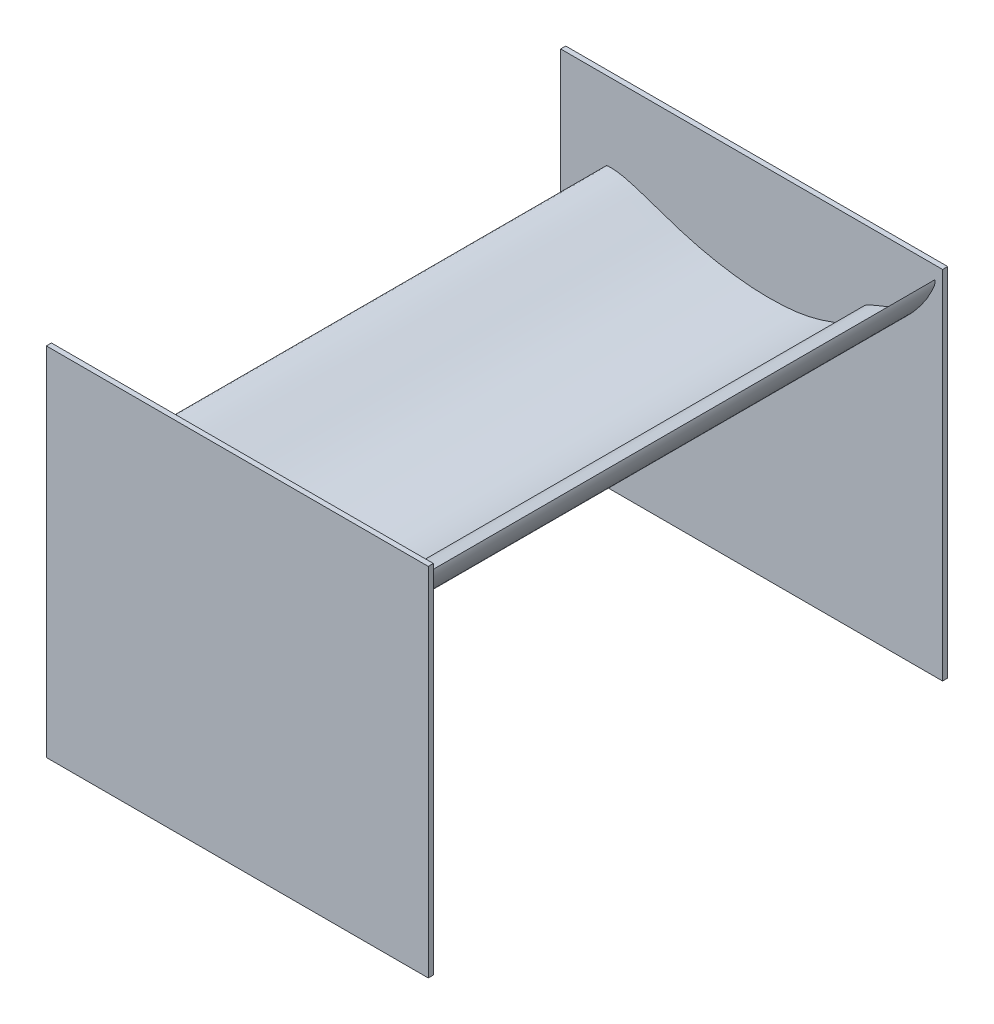
ISO-10303-21;
HEADER;
FILE_DESCRIPTION(('STEP AP214'),'2;1');
FILE_NAME('part.step','',(''),(''),'','','');
FILE_SCHEMA(('AUTOMOTIVE_DESIGN { 1 0 10303 214 1 1 1 1 }'));
ENDSEC;
DATA;
#1=APPLICATION_CONTEXT('core data for automotive mechanical design processes');
#2=APPLICATION_PROTOCOL_DEFINITION('international standard','automotive_design',2000,#1);
#3=PRODUCT_CONTEXT('',#1,'mechanical');
#4=PRODUCT('Part','Part','',(#3));
#5=PRODUCT_RELATED_PRODUCT_CATEGORY('part','',(#4));
#6=PRODUCT_DEFINITION_FORMATION('','',#4);
#7=PRODUCT_DEFINITION_CONTEXT('part definition',#1,'design');
#8=PRODUCT_DEFINITION('design','',#6,#7);
#9=PRODUCT_DEFINITION_SHAPE('','',#8);
#10=(LENGTH_UNIT() NAMED_UNIT(*) SI_UNIT(.MILLI.,.METRE.));
#11=(NAMED_UNIT(*) PLANE_ANGLE_UNIT() SI_UNIT($,.RADIAN.));
#12=(NAMED_UNIT(*) SI_UNIT($,.STERADIAN.) SOLID_ANGLE_UNIT());
#13=UNCERTAINTY_MEASURE_WITH_UNIT(LENGTH_MEASURE(1.E-05),#10,'distance_accuracy_value','');
#14=(GEOMETRIC_REPRESENTATION_CONTEXT(3) GLOBAL_UNCERTAINTY_ASSIGNED_CONTEXT((#13)) GLOBAL_UNIT_ASSIGNED_CONTEXT((#10,
#11,#12)) REPRESENTATION_CONTEXT('',''));
#15=CARTESIAN_POINT('',(0.,0.,0.));
#16=DIRECTION('',(0.,0.,1.));
#17=DIRECTION('',(1.,0.,0.));
#18=AXIS2_PLACEMENT_3D('',#15,#16,#17);
#19=CARTESIAN_POINT('',(0.,0.,0.));
#20=DIRECTION('',(0.,0.,1.));
#21=DIRECTION('',(1.,0.,0.));
#22=AXIS2_PLACEMENT_3D('',#19,#20,#21);
#23=PLANE('',#22);
#24=CARTESIAN_POINT('',(273.299712978964,1047.45924181801,0.));
#25=CARTESIAN_POINT('',(271.501355354195,1047.49714314853,0.));
#26=CARTESIAN_POINT('',(268.935333839832,1047.45862079723,0.));
#27=CARTESIAN_POINT('',(265.939505315287,1047.20209324639,0.));
#28=CARTESIAN_POINT('',(264.564566318725,1047.05271328186,0.));
#29=CARTESIAN_POINT('',(263.813674420036,1046.88467552736,0.));
#30=CARTESIAN_POINT('',(263.388633667222,1046.74138422288,0.));
#31=CARTESIAN_POINT('',(263.030882370473,1046.56914235734,0.));
#32=CARTESIAN_POINT('',(262.72359100929,1046.36780452043,0.));
#33=CARTESIAN_POINT('',(262.423321422774,1046.10363217531,0.));
#34=CARTESIAN_POINT('',(262.09115865647,1045.72021037039,0.));
#35=CARTESIAN_POINT('',(261.668419190282,1045.07844679946,0.));
#36=CARTESIAN_POINT('',(261.323583140103,1044.37432086651,0.));
#37=CARTESIAN_POINT('',(260.89977269643,1043.36478184622,0.));
#38=CARTESIAN_POINT('',(260.518417740157,1042.17581697044,0.));
#39=CARTESIAN_POINT('',(260.22469576341,1040.56281707426,0.));
#40=CARTESIAN_POINT('',(260.138135098674,1039.06434583294,0.));
#41=CARTESIAN_POINT('',(260.203063122095,1037.09214786162,0.));
#42=CARTESIAN_POINT('',(260.611872972944,1034.20212866157,0.));
#43=CARTESIAN_POINT('',(261.580690993355,1030.67510966762,0.));
#44=CARTESIAN_POINT('',(262.924936167258,1026.53626815487,0.));
#45=CARTESIAN_POINT('',(264.596716896282,1022.29037801087,0.));
#46=CARTESIAN_POINT('',(267.035615286334,1017.6559299152,0.));
#47=CARTESIAN_POINT('',(270.009457862836,1013.02917999467,0.));
#48=CARTESIAN_POINT('',(273.632028611518,1008.26358873022,0.));
#49=CARTESIAN_POINT('',(277.935771872126,1003.38587489967,0.));
#50=CARTESIAN_POINT('',(282.941696886936,998.478252720664,0.));
#51=CARTESIAN_POINT('',(288.613294541212,993.619147129829,0.));
#52=CARTESIAN_POINT('',(294.983232627773,988.81130685789,0.));
#53=CARTESIAN_POINT('',(302.118947935058,984.023338084991,0.));
#54=CARTESIAN_POINT('',(308.778415274983,980.041290493165,0.));
#55=CARTESIAN_POINT('',(316.02667249154,976.106358714042,0.));
#56=CARTESIAN_POINT('',(323.739917947677,972.327810125775,0.));
#57=CARTESIAN_POINT('',(333.232925599972,968.263721419377,0.));
#58=CARTESIAN_POINT('',(343.221010036048,964.560966365891,0.));
#59=CARTESIAN_POINT('',(353.709288129129,961.233979804842,0.));
#60=CARTESIAN_POINT('',(364.679055460699,958.307258750135,0.));
#61=CARTESIAN_POINT('',(372.749680261371,956.531908465284,0.));
#62=CARTESIAN_POINT('',(381.498353904149,954.801019637278,0.));
#63=CARTESIAN_POINT('',(391.043359437042,953.143578783363,0.));
#64=CARTESIAN_POINT('',(405.421970477268,951.114933645766,0.));
#65=CARTESIAN_POINT('',(421.094244252914,949.326195385743,0.));
#66=CARTESIAN_POINT('',(437.613792232812,947.990281359828,0.));
#67=CARTESIAN_POINT('',(454.031107784313,947.24890983834,0.));
#68=CARTESIAN_POINT('',(470.05903254369,947.11319949093,0.));
#69=CARTESIAN_POINT('',(486.066732644042,947.517716420878,0.));
#70=CARTESIAN_POINT('',(502.604583945234,948.469446243578,0.));
#71=CARTESIAN_POINT('',(519.666548518223,949.992414414784,0.));
#72=CARTESIAN_POINT('',(537.309174727318,952.10401092601,0.));
#73=CARTESIAN_POINT('',(555.417065812161,954.79345528198,0.));
#74=CARTESIAN_POINT('',(574.256086511726,958.110054986406,0.));
#75=CARTESIAN_POINT('',(593.929976525561,962.092902134031,0.));
#76=CARTESIAN_POINT('',(613.479460616961,966.522733281033,0.));
#77=CARTESIAN_POINT('',(632.248568521534,971.26887023469,0.));
#78=CARTESIAN_POINT('',(650.223764529532,976.3241944404,0.));
#79=CARTESIAN_POINT('',(667.769452220553,981.823217486045,0.));
#80=CARTESIAN_POINT('',(685.092355157296,987.874337913877,0.));
#81=CARTESIAN_POINT('',(701.773807616945,994.298766738725,0.));
#82=CARTESIAN_POINT('',(717.160205750105,1000.80700390757,0.));
#83=CARTESIAN_POINT('',(730.651265057758,1006.97118190653,0.));
#84=CARTESIAN_POINT('',(741.192814950402,1012.23074840225,0.));
#85=CARTESIAN_POINT('',(749.127527913007,1016.52220400929,0.));
#86=CARTESIAN_POINT('',(754.972629258018,1020.0120965144,0.));
#87=CARTESIAN_POINT('',(759.653468517524,1023.28306910494,0.));
#88=CARTESIAN_POINT('',(763.739864161134,1026.69777677455,0.));
#89=CARTESIAN_POINT('',(767.581583797698,1030.7159639199,0.));
#90=CARTESIAN_POINT('',(770.276177429681,1034.08723585971,0.));
#91=CARTESIAN_POINT('',(775.398740275752,1041.41835338453,0.));
#92=CARTESIAN_POINT('',(767.166879825847,1032.40522998706,0.));
#93=CARTESIAN_POINT('',(762.514436028774,1029.07305066966,0.));
#94=CARTESIAN_POINT('',(756.057294195145,1024.31088319617,0.));
#95=CARTESIAN_POINT('',(749.561358229946,1020.4131543083,0.));
#96=CARTESIAN_POINT('',(742.404140579619,1016.6392482191,0.));
#97=CARTESIAN_POINT('',(733.82716496417,1012.70305847589,0.));
#98=CARTESIAN_POINT('',(721.478784182814,1007.74740437754,0.));
#99=CARTESIAN_POINT('',(707.436834403415,1002.53654793299,0.));
#100=CARTESIAN_POINT('',(692.95385082075,997.416011510719,0.));
#101=CARTESIAN_POINT('',(680.508215201084,993.568550593356,0.));
#102=CARTESIAN_POINT('',(668.097102094708,990.236350557277,0.));
#103=CARTESIAN_POINT('',(655.603931210656,987.45278636365,0.));
#104=CARTESIAN_POINT('',(642.86274947735,985.196412287056,0.));
#105=CARTESIAN_POINT('',(630.135759526326,983.513369063551,0.));
#106=CARTESIAN_POINT('',(617.08130883258,982.341702283071,0.));
#107=CARTESIAN_POINT('',(603.127332505453,981.563579542028,0.));
#108=CARTESIAN_POINT('',(587.780241229943,981.131091145351,0.));
#109=CARTESIAN_POINT('',(571.414754972608,981.189588101737,0.));
#110=CARTESIAN_POINT('',(554.748610523876,981.817396349114,0.));
#111=CARTESIAN_POINT('',(537.695772248325,983.059469228186,0.));
#112=CARTESIAN_POINT('',(520.269878600214,984.920915856248,0.));
#113=CARTESIAN_POINT('',(502.232039320122,987.417966685022,0.));
#114=CARTESIAN_POINT('',(483.775625836703,990.476782520715,0.));
#115=CARTESIAN_POINT('',(465.058500382055,994.099847318854,0.));
#116=CARTESIAN_POINT('',(446.544938305797,998.281923251767,0.));
#117=CARTESIAN_POINT('',(428.619106679511,1002.94413087325,0.));
#118=CARTESIAN_POINT('',(410.542007430251,1008.17678908451,0.));
#119=CARTESIAN_POINT('',(391.371985369232,1014.218797921,0.));
#120=CARTESIAN_POINT('',(370.526687937025,1021.27441790733,0.));
#121=CARTESIAN_POINT('',(350.022594856783,1028.50628972639,0.));
#122=CARTESIAN_POINT('',(331.74706073568,1034.66476528182,0.));
#123=CARTESIAN_POINT('',(317.275489281966,1039.12552566214,0.));
#124=CARTESIAN_POINT('',(305.63469302552,1042.34715389404,0.));
#125=CARTESIAN_POINT('',(295.850133380513,1044.63590198182,0.));
#126=CARTESIAN_POINT('',(287.313017908039,1046.20470166339,0.));
#127=CARTESIAN_POINT('',(279.935988714214,1047.12947871134,0.));
#128=CARTESIAN_POINT('',(275.363404042483,1047.41574844606,0.));
#129=CARTESIAN_POINT('',(273.299712978964,1047.45924181801,0.));
#130=B_SPLINE_CURVE_WITH_KNOTS('',3,(#24,#25,#26,#27,#28,#29,#30,#31,#32,#33,#34,#35,#36,#37,
#38,#39,#40,#41,#42,#43,#44,#45,#46,#47,#48,#49,#50,#51,#52,#53,#54,#55,#56,#57,#58,#59,#60,#61,
#62,#63,#64,#65,#66,#67,#68,#69,#70,#71,#72,#73,#74,#75,#76,#77,#78,#79,#80,#81,#82,#83,#84,#85,
#86,#87,#88,#89,#90,#91,#92,#93,#94,#95,#96,#97,#98,#99,#100,#101,#102,#103,#104,#105,#106,#107,
#108,#109,#110,#111,#112,#113,#114,#115,#116,#117,#118,#119,#120,#121,#122,#123,#124,#125,#126,
#127,#128,#129),.UNSPECIFIED.,.T.,.F.,(4,1,1,1,1,1,1,1,1,1,1,1,1,1,1,1,1,1,1,1,1,1,1,1,1,1,1,1,
1,1,1,1,1,1,1,1,1,1,1,1,1,1,1,1,1,1,1,1,1,1,1,1,1,1,1,1,1,1,1,1,1,1,1,1,1,1,1,1,1,1,1,1,1,1,1,1,
1,1,1,1,1,1,1,1,1,1,1,1,1,1,1,1,1,1,1,1,1,1,1,1,1,1,1,4),(0.,0.00486498720637252,
0.00693254524521891,0.00813788435669305,0.00860149727128035,0.00901181840696386,
0.00934865279773456,0.0096731642835618,0.0100026596108538,0.0104275748205012,0.0110418174822611,
0.0120766326629139,0.0125434720315457,0.014004596260203,0.0154435818399652,0.0169687663105577,
0.0180560683135106,0.0207795247726854,0.0248406343782316,0.0279358855564014,0.0325554535440554,
0.0371663626143194,0.0420821080159116,0.0474218776089789,0.0533481896207324,0.0596674467011705,
0.0663745655860388,0.0735423368115471,0.0812490197247285,0.0896154033323993,0.0945263674953617,
0.103562344523124,0.112843807907009,0.122455999221578,0.132373756408963,0.14260534815104,
0.153165587614205,0.154726060672372,0.166736316983418,0.179371763289159,0.194012659114079,
0.209411026755962,0.224206692179842,0.238469752089365,0.252771690585992,0.267526239366753,
0.283284172444976,0.299113578757103,0.315597400733655,0.332811402570589,0.350865810671034,
0.369905470866038,0.387043715821497,0.403243824516595,0.420423249014811,0.436786871378303,
0.452885030332324,0.468782715546349,0.48198343638645,0.49301168675148,0.500654808832816,
0.506381799232014,0.511437541320662,0.516043966627856,0.520925913945336,0.525830531207915,
0.529953558671425,0.536609682497579,0.543291188228846,0.550106034163821,0.557026954660342,
0.564113346016075,0.571894396282258,0.58258008266935,0.600094179547477,0.61242484092006,
0.624138462179078,0.635332149629944,0.64718748312066,0.6587592246628,0.670332543322906,
0.681912601165571,0.694215176194797,0.708142392645253,0.723449251782781,0.73848835212507,
0.753260173450307,0.769704083265492,0.785898215648005,0.802525572661821,0.820318822274027,
0.837475337311733,0.853872349782661,0.870428328602395,0.888390885544636,0.908253004939095,
0.929971273954701,0.947220557189022,0.960430627996534,0.970941391538835,0.979895840022844,
0.987611288807097,0.99441722242359,1.),.UNSPECIFIED.);
#131=CARTESIAN_POINT('',(273.299712978964,1047.45924181801,0.));
#132=VERTEX_POINT('',#131);
#133=EDGE_CURVE('E84',#132,#132,#130,.T.);
#134=ORIENTED_EDGE('',*,*,#133,.F.);
#135=EDGE_LOOP('',(#134));
#136=FACE_BOUND('',#135,.T.);
#137=DIRECTION('',(0.,-1.,0.));
#138=VECTOR('',#137,1.);
#139=CARTESIAN_POINT('',(923.,0.,0.));
#140=LINE('',#139,#138);
#141=CARTESIAN_POINT('',(923.,1200.,0.));
#142=VERTEX_POINT('',#141);
#143=CARTESIAN_POINT('',(923.,500.,0.));
#144=VERTEX_POINT('',#143);
#145=EDGE_CURVE('E205',#142,#144,#140,.T.);
#146=ORIENTED_EDGE('',*,*,#145,.F.);
#147=DIRECTION('',(1.,0.,0.));
#148=VECTOR('',#147,1.);
#149=CARTESIAN_POINT('',(0.,1200.,0.));
#150=LINE('',#149,#148);
#151=CARTESIAN_POINT('',(173.,1200.,0.));
#152=VERTEX_POINT('',#151);
#153=EDGE_CURVE('E253',#152,#142,#150,.T.);
#154=ORIENTED_EDGE('',*,*,#153,.F.);
#155=DIRECTION('',(0.,-1.,0.));
#156=VECTOR('',#155,1.);
#157=CARTESIAN_POINT('',(173.,0.,0.));
#158=LINE('',#157,#156);
#159=CARTESIAN_POINT('',(173.,500.,0.));
#160=VERTEX_POINT('',#159);
#161=EDGE_CURVE('E257',#152,#160,#158,.T.);
#162=ORIENTED_EDGE('',*,*,#161,.T.);
#163=DIRECTION('',(1.,0.,0.));
#164=VECTOR('',#163,1.);
#165=CARTESIAN_POINT('',(0.,500.,0.));
#166=LINE('',#165,#164);
#167=EDGE_CURVE('E255',#160,#144,#166,.T.);
#168=ORIENTED_EDGE('',*,*,#167,.T.);
#169=EDGE_LOOP('',(#146,#154,#162,#168));
#170=FACE_BOUND('',#169,.T.);
#171=CARTESIAN_POINT('',(770.198118118824,1062.25924181801,0.));
#172=CARTESIAN_POINT('',(769.701305805667,1061.85559247131,0.));
#173=CARTESIAN_POINT('',(769.013734262179,1061.25450448536,0.));
#174=CARTESIAN_POINT('',(768.259688955732,1060.49531756154,0.));
#175=CARTESIAN_POINT('',(767.920903164386,1060.13829877015,0.));
#176=CARTESIAN_POINT('',(767.755783207504,1059.91985583616,0.));
#177=CARTESIAN_POINT('',(767.673405810876,1059.78313190751,0.));
#178=CARTESIAN_POINT('',(767.615954982367,1059.65403888592,0.));
#179=CARTESIAN_POINT('',(767.578896527597,1059.52866357941,0.));
#180=CARTESIAN_POINT('',(767.558206739122,1059.38785072699,0.));
#181=CARTESIAN_POINT('',(767.556309075683,1059.20733163728,0.));
#182=CARTESIAN_POINT('',(767.589291870628,1058.93584811532,0.));
#183=CARTESIAN_POINT('',(767.657772490403,1058.66537033795,0.));
#184=CARTESIAN_POINT('',(767.77511714352,1058.29382315683,0.));
#185=CARTESIAN_POINT('',(767.945283806028,1057.8833505589,0.));
#186=CARTESIAN_POINT('',(768.236836796396,1057.37796240095,0.));
#187=CARTESIAN_POINT('',(768.558253419234,1056.9513414713,0.));
#188=CARTESIAN_POINT('',(769.02982507548,1056.43101621685,0.));
#189=CARTESIAN_POINT('',(769.80598800409,1055.74073989482,0.));
#190=CARTESIAN_POINT('',(770.880762659817,1055.00647642226,0.));
#191=CARTESIAN_POINT('',(772.198257137504,1054.19257326658,0.));
#192=CARTESIAN_POINT('',(773.629287204178,1053.42500660341,0.));
#193=CARTESIAN_POINT('',(775.357955165086,1052.7285531818,0.));
#194=CARTESIAN_POINT('',(777.230039258929,1052.15731961565,0.));
#195=CARTESIAN_POINT('',(779.310151014132,1051.6977240997,0.));
#196=CARTESIAN_POINT('',(781.600946098188,1051.3644861799,0.));
#197=CARTESIAN_POINT('',(784.089202968187,1051.18475523291,0.));
#198=CARTESIAN_POINT('',(786.746961342947,1051.17141293569,0.));
#199=CARTESIAN_POINT('',(789.58245483047,1051.33272460819,0.));
#200=CARTESIAN_POINT('',(792.621212361905,1051.67569195002,0.));
#201=CARTESIAN_POINT('',(795.345209947722,1052.12777249706,0.));
#202=CARTESIAN_POINT('',(798.218164874995,1052.72816506098,0.));
#203=CARTESIAN_POINT('',(801.18132584239,1053.47802968715,0.));
#204=CARTESIAN_POINT('',(804.693252311382,1054.5600523533,0.));
#205=CARTESIAN_POINT('',(808.256376717907,1055.8540978635,0.));
#206=CARTESIAN_POINT('',(811.868765289586,1057.36526172038,0.));
#207=CARTESIAN_POINT('',(815.519702912353,1059.09588732587,0.));
#208=CARTESIAN_POINT('',(818.118774276321,1060.4716953272,0.));
#209=CARTESIAN_POINT('',(820.89163953154,1062.01564007003,0.));
#210=CARTESIAN_POINT('',(823.863729669769,1063.7628144643,0.));
#211=CARTESIAN_POINT('',(828.23314009207,1066.52181382558,0.));
#212=CARTESIAN_POINT('',(832.898440302782,1069.64369397123,0.));
#213=CARTESIAN_POINT('',(837.689468800288,1073.08349508862,0.));
#214=CARTESIAN_POINT('',(842.315902090018,1076.66112841645,0.));
#215=CARTESIAN_POINT('',(846.697243900953,1080.31351511647,0.));
#216=CARTESIAN_POINT('',(850.948750037444,1084.10786854468,0.));
#217=CARTESIAN_POINT('',(855.218188922964,1088.17276713991,0.));
#218=CARTESIAN_POINT('',(859.498391768868,1092.5133418224,0.));
#219=CARTESIAN_POINT('',(863.800703513088,1097.14732836393,0.));
#220=CARTESIAN_POINT('',(868.096285962998,1102.04523946185,0.));
#221=CARTESIAN_POINT('',(872.445947568327,1107.28165284334,0.));
#222=CARTESIAN_POINT('',(876.868846095541,1112.89105664354,0.));
#223=CARTESIAN_POINT('',(881.155095559438,1118.59314034331,0.));
#224=CARTESIAN_POINT('',(885.156739262287,1124.20144922697,0.));
#225=CARTESIAN_POINT('',(888.871742015828,1129.71093568765,0.));
#226=CARTESIAN_POINT('',(892.368044678175,1135.24198363894,0.));
#227=CARTESIAN_POINT('',(895.67680306879,1140.87159578966,0.));
#228=CARTESIAN_POINT('',(898.725540685174,1146.45488123098,0.));
#229=CARTESIAN_POINT('',(901.403499835371,1151.76282443449,0.));
#230=CARTESIAN_POINT('',(903.646242779225,1156.54112861019,0.));
#231=CARTESIAN_POINT('',(905.296684186183,1160.39501226168,0.));
#232=CARTESIAN_POINT('',(906.462444001126,1163.3861156243,0.));
#233=CARTESIAN_POINT('',(907.245566185517,1165.67869315361,0.));
#234=CARTESIAN_POINT('',(907.763088271198,1167.64387065504,0.));
#235=CARTESIAN_POINT('',(908.086189537716,1169.51123322501,0.));
#236=CARTESIAN_POINT('',(908.203978226784,1171.48606669029,0.));
#237=CARTESIAN_POINT('',(908.159331285953,1173.02128313078,0.));
#238=CARTESIAN_POINT('',(907.86219879773,1176.19008938303,0.));
#239=CARTESIAN_POINT('',(907.702598338451,1171.8490924985,0.));
#240=CARTESIAN_POINT('',(907.206871232144,1169.87383892169,0.));
#241=CARTESIAN_POINT('',(906.550481702573,1167.09507985367,0.));
#242=CARTESIAN_POINT('',(905.684591422257,1164.54200679195,0.));
#243=CARTESIAN_POINT('',(904.610723244629,1161.87033003025,0.));
#244=CARTESIAN_POINT('',(903.18887515561,1158.82781613078,0.));
#245=CARTESIAN_POINT('',(900.978092760961,1154.64053029753,0.));
#246=CARTESIAN_POINT('',(898.366403502034,1149.99416414579,0.));
#247=CARTESIAN_POINT('',(895.614224836741,1145.27079682315,0.));
#248=CARTESIAN_POINT('',(893.121968904145,1141.36189774526,0.));
#249=CARTESIAN_POINT('',(890.520482737667,1137.60079072241,0.));
#250=CARTESIAN_POINT('',(887.770443465119,1133.96970017127,0.));
#251=CARTESIAN_POINT('',(884.83174637769,1130.42460738827,0.));
#252=CARTESIAN_POINT('',(881.764934909514,1127.0383876912,0.));
#253=CARTESIAN_POINT('',(878.491542205427,1123.71558646744,0.));
#254=CARTESIAN_POINT('',(874.883427372514,1120.29254832681,0.));
#255=CARTESIAN_POINT('',(870.817653981425,1116.64265852812,0.));
#256=CARTESIAN_POINT('',(866.362467880527,1112.89161745817,0.));
#257=CARTESIAN_POINT('',(861.694639842188,1109.2258880984,0.));
#258=CARTESIAN_POINT('',(856.780472006081,1105.63786792949,0.));
#259=CARTESIAN_POINT('',(851.622489967364,1102.13208283041,0.));
#260=CARTESIAN_POINT('',(846.152121196005,1098.65795142748,0.));
#261=CARTESIAN_POINT('',(840.438844116974,1095.23994235494,0.));
#262=CARTESIAN_POINT('',(834.524932037551,1091.91506563805,0.));
#263=CARTESIAN_POINT('',(828.537598550904,1088.78876403532,0.));
#264=CARTESIAN_POINT('',(822.599265656619,1085.9280545084,0.));
#265=CARTESIAN_POINT('',(816.488574361757,1083.18735180561,0.));
#266=CARTESIAN_POINT('',(809.894963351208,1080.41475026263,0.));
#267=CARTESIAN_POINT('',(802.613361999438,1077.53164508248,0.));
#268=CARTESIAN_POINT('',(795.38379751312,1074.77491257583,0.));
#269=CARTESIAN_POINT('',(789.006149890907,1072.23980932936,0.));
#270=CARTESIAN_POINT('',(784.051698373744,1070.11950804331,0.));
#271=CARTESIAN_POINT('',(780.150758115055,1068.31446881677,0.));
#272=CARTESIAN_POINT('',(776.968340281636,1066.68349691967,0.));
#273=CARTESIAN_POINT('',(774.290202364673,1065.14425520448,0.));
#274=CARTESIAN_POINT('',(772.075158568497,1063.69724296312,0.));
#275=CARTESIAN_POINT('',(770.768231157959,1062.72244643211,0.));
#276=CARTESIAN_POINT('',(770.198118118824,1062.25924181801,0.));
#277=B_SPLINE_CURVE_WITH_KNOTS('',3,(#171,#172,#173,#174,#175,#176,#177,#178,#179,#180,#181,
#182,#183,#184,#185,#186,#187,#188,#189,#190,#191,#192,#193,#194,#195,#196,#197,#198,#199,#200,
#201,#202,#203,#204,#205,#206,#207,#208,#209,#210,#211,#212,#213,#214,#215,#216,#217,#218,#219,
#220,#221,#222,#223,#224,#225,#226,#227,#228,#229,#230,#231,#232,#233,#234,#235,#236,#237,#238,
#239,#240,#241,#242,#243,#244,#245,#246,#247,#248,#249,#250,#251,#252,#253,#254,#255,#256,#257,
#258,#259,#260,#261,#262,#263,#264,#265,#266,#267,#268,#269,#270,#271,#272,#273,#274,#275,#276),
.UNSPECIFIED.,.T.,.F.,(4,1,1,1,1,1,1,1,1,1,1,1,1,1,1,1,1,1,1,1,1,1,1,1,1,1,1,1,1,1,1,1,1,1,1,1,
1,1,1,1,1,1,1,1,1,1,1,1,1,1,1,1,1,1,1,1,1,1,1,1,1,1,1,1,1,1,1,1,1,1,1,1,1,1,1,1,1,1,1,1,1,1,1,1,
1,1,1,1,1,1,1,1,1,1,1,1,1,1,1,1,1,1,1,4),(0.,0.00486498720637252,0.00693254524521891,
0.00813788435669305,0.00860149727128035,0.00901181840696386,0.00934865279773456,
0.0096731642835618,0.0100026596108538,0.0104275748205012,0.0110418174822611,0.0120766326629139,
0.0125434720315457,0.014004596260203,0.0154435818399652,0.0169687663105577,0.0180560683135106,
0.0207795247726854,0.0248406343782316,0.0279358855564014,0.0325554535440554,0.0371663626143194,
0.0420821080159116,0.0474218776089789,0.0533481896207324,0.0596674467011705,0.0663745655860388,
0.0735423368115471,0.0812490197247285,0.0896154033323993,0.0945263674953617,0.103562344523124,
0.112843807907009,0.122455999221578,0.132373756408963,0.14260534815104,0.153165587614205,
0.154726060672372,0.166736316983418,0.179371763289159,0.194012659114079,0.209411026755962,
0.224206692179842,0.238469752089365,0.252771690585992,0.267526239366753,0.283284172444976,
0.299113578757103,0.315597400733655,0.332811402570589,0.350865810671034,0.369905470866038,
0.387043715821497,0.403243824516595,0.420423249014811,0.436786871378303,0.452885030332324,
0.468782715546349,0.48198343638645,0.49301168675148,0.500654808832816,0.506381799232014,
0.511437541320662,0.516043966627856,0.520925913945336,0.525830531207915,0.529953558671425,
0.536609682497579,0.543291188228846,0.550106034163821,0.557026954660342,0.564113346016075,
0.571894396282258,0.58258008266935,0.600094179547477,0.61242484092006,0.624138462179078,
0.635332149629944,0.64718748312066,0.6587592246628,0.670332543322906,0.681912601165571,
0.694215176194797,0.708142392645253,0.723449251782781,0.73848835212507,0.753260173450307,
0.769704083265492,0.785898215648005,0.802525572661821,0.820318822274027,0.837475337311733,
0.853872349782661,0.870428328602395,0.888390885544636,0.908253004939095,0.929971273954701,
0.947220557189022,0.960430627996534,0.970941391538835,0.979895840022844,0.987611288807097,
0.99441722242359,1.),.UNSPECIFIED.);
#278=CARTESIAN_POINT('',(770.198118118824,1062.25924181801,0.));
#279=VERTEX_POINT('',#278);
#280=EDGE_CURVE('E200',#279,#279,#277,.T.);
#281=ORIENTED_EDGE('',*,*,#280,.F.);
#282=EDGE_LOOP('',(#281));
#283=FACE_BOUND('',#282,.T.);
#284=ADVANCED_FACE('F79',(#136,#170,#283),#23,.T.);
#285=CARTESIAN_POINT('',(273.299712978964,1047.45924181801,1000.));
#286=CARTESIAN_POINT('',(271.501355354195,1047.49714314853,1000.));
#287=CARTESIAN_POINT('',(268.935333839832,1047.45862079723,1000.));
#288=CARTESIAN_POINT('',(265.939505315287,1047.20209324639,1000.));
#289=CARTESIAN_POINT('',(264.564566318725,1047.05271328186,1000.));
#290=CARTESIAN_POINT('',(263.813674420036,1046.88467552736,1000.));
#291=CARTESIAN_POINT('',(263.388633667222,1046.74138422288,1000.));
#292=CARTESIAN_POINT('',(263.030882370473,1046.56914235734,1000.));
#293=CARTESIAN_POINT('',(262.72359100929,1046.36780452043,1000.));
#294=CARTESIAN_POINT('',(262.423321422774,1046.10363217531,1000.));
#295=CARTESIAN_POINT('',(262.09115865647,1045.72021037039,1000.));
#296=CARTESIAN_POINT('',(261.668419190282,1045.07844679946,1000.));
#297=CARTESIAN_POINT('',(261.323583140103,1044.37432086651,1000.));
#298=CARTESIAN_POINT('',(260.89977269643,1043.36478184622,1000.));
#299=CARTESIAN_POINT('',(260.518417740157,1042.17581697044,1000.));
#300=CARTESIAN_POINT('',(260.22469576341,1040.56281707426,1000.));
#301=CARTESIAN_POINT('',(260.138135098674,1039.06434583294,1000.));
#302=CARTESIAN_POINT('',(260.203063122095,1037.09214786162,1000.));
#303=CARTESIAN_POINT('',(260.611872972944,1034.20212866157,1000.));
#304=CARTESIAN_POINT('',(261.580690993355,1030.67510966762,1000.));
#305=CARTESIAN_POINT('',(262.924936167258,1026.53626815487,1000.));
#306=CARTESIAN_POINT('',(264.596716896282,1022.29037801087,1000.));
#307=CARTESIAN_POINT('',(267.035615286334,1017.6559299152,1000.));
#308=CARTESIAN_POINT('',(270.009457862836,1013.02917999467,1000.));
#309=CARTESIAN_POINT('',(273.632028611518,1008.26358873022,1000.));
#310=CARTESIAN_POINT('',(277.935771872126,1003.38587489967,1000.));
#311=CARTESIAN_POINT('',(282.941696886936,998.478252720664,1000.));
#312=CARTESIAN_POINT('',(288.613294541212,993.619147129829,1000.));
#313=CARTESIAN_POINT('',(294.983232627773,988.81130685789,1000.));
#314=CARTESIAN_POINT('',(302.118947935058,984.023338084991,1000.));
#315=CARTESIAN_POINT('',(308.778415274983,980.041290493165,1000.));
#316=CARTESIAN_POINT('',(316.02667249154,976.106358714042,1000.));
#317=CARTESIAN_POINT('',(323.739917947677,972.327810125775,1000.));
#318=CARTESIAN_POINT('',(333.232925599972,968.263721419377,1000.));
#319=CARTESIAN_POINT('',(343.221010036048,964.560966365891,1000.));
#320=CARTESIAN_POINT('',(353.709288129129,961.233979804842,1000.));
#321=CARTESIAN_POINT('',(364.679055460699,958.307258750135,1000.));
#322=CARTESIAN_POINT('',(372.749680261371,956.531908465284,1000.));
#323=CARTESIAN_POINT('',(381.498353904149,954.801019637278,1000.));
#324=CARTESIAN_POINT('',(391.043359437042,953.143578783363,1000.));
#325=CARTESIAN_POINT('',(405.421970477268,951.114933645766,1000.));
#326=CARTESIAN_POINT('',(421.094244252914,949.326195385743,1000.));
#327=CARTESIAN_POINT('',(437.613792232812,947.990281359828,1000.));
#328=CARTESIAN_POINT('',(454.031107784313,947.24890983834,1000.));
#329=CARTESIAN_POINT('',(470.05903254369,947.11319949093,1000.));
#330=CARTESIAN_POINT('',(486.066732644042,947.517716420878,1000.));
#331=CARTESIAN_POINT('',(502.604583945234,948.469446243578,1000.));
#332=CARTESIAN_POINT('',(519.666548518223,949.992414414784,1000.));
#333=CARTESIAN_POINT('',(537.309174727318,952.10401092601,1000.));
#334=CARTESIAN_POINT('',(555.417065812161,954.79345528198,1000.));
#335=CARTESIAN_POINT('',(574.256086511726,958.110054986406,1000.));
#336=CARTESIAN_POINT('',(593.929976525561,962.092902134031,1000.));
#337=CARTESIAN_POINT('',(613.479460616961,966.522733281033,1000.));
#338=CARTESIAN_POINT('',(632.248568521534,971.26887023469,1000.));
#339=CARTESIAN_POINT('',(650.223764529532,976.3241944404,1000.));
#340=CARTESIAN_POINT('',(667.769452220553,981.823217486045,1000.));
#341=CARTESIAN_POINT('',(685.092355157296,987.874337913877,1000.));
#342=CARTESIAN_POINT('',(701.773807616945,994.298766738725,1000.));
#343=CARTESIAN_POINT('',(717.160205750105,1000.80700390757,1000.));
#344=CARTESIAN_POINT('',(730.651265057758,1006.97118190653,1000.));
#345=CARTESIAN_POINT('',(741.192814950402,1012.23074840225,1000.));
#346=CARTESIAN_POINT('',(749.127527913007,1016.52220400929,1000.));
#347=CARTESIAN_POINT('',(754.972629258018,1020.0120965144,1000.));
#348=CARTESIAN_POINT('',(759.653468517524,1023.28306910494,1000.));
#349=CARTESIAN_POINT('',(763.739864161134,1026.69777677455,1000.));
#350=CARTESIAN_POINT('',(767.581583797698,1030.7159639199,1000.));
#351=CARTESIAN_POINT('',(770.276177429681,1034.08723585971,1000.));
#352=CARTESIAN_POINT('',(775.398740275752,1041.41835338453,1000.));
#353=CARTESIAN_POINT('',(767.166879825847,1032.40522998706,1000.));
#354=CARTESIAN_POINT('',(762.514436028774,1029.07305066966,1000.));
#355=CARTESIAN_POINT('',(756.057294195145,1024.31088319617,1000.));
#356=CARTESIAN_POINT('',(749.561358229946,1020.4131543083,1000.));
#357=CARTESIAN_POINT('',(742.404140579619,1016.6392482191,1000.));
#358=CARTESIAN_POINT('',(733.82716496417,1012.70305847589,1000.));
#359=CARTESIAN_POINT('',(721.478784182814,1007.74740437754,1000.));
#360=CARTESIAN_POINT('',(707.436834403415,1002.53654793299,1000.));
#361=CARTESIAN_POINT('',(692.95385082075,997.416011510719,1000.));
#362=CARTESIAN_POINT('',(680.508215201084,993.568550593356,1000.));
#363=CARTESIAN_POINT('',(668.097102094708,990.236350557277,1000.));
#364=CARTESIAN_POINT('',(655.603931210656,987.45278636365,1000.));
#365=CARTESIAN_POINT('',(642.86274947735,985.196412287056,1000.));
#366=CARTESIAN_POINT('',(630.135759526326,983.513369063551,1000.));
#367=CARTESIAN_POINT('',(617.08130883258,982.341702283071,1000.));
#368=CARTESIAN_POINT('',(603.127332505453,981.563579542028,1000.));
#369=CARTESIAN_POINT('',(587.780241229943,981.131091145351,1000.));
#370=CARTESIAN_POINT('',(571.414754972608,981.189588101737,1000.));
#371=CARTESIAN_POINT('',(554.748610523876,981.817396349114,1000.));
#372=CARTESIAN_POINT('',(537.695772248325,983.059469228186,1000.));
#373=CARTESIAN_POINT('',(520.269878600214,984.920915856248,1000.));
#374=CARTESIAN_POINT('',(502.232039320122,987.417966685022,1000.));
#375=CARTESIAN_POINT('',(483.775625836703,990.476782520715,1000.));
#376=CARTESIAN_POINT('',(465.058500382055,994.099847318854,1000.));
#377=CARTESIAN_POINT('',(446.544938305797,998.281923251767,1000.));
#378=CARTESIAN_POINT('',(428.619106679511,1002.94413087325,1000.));
#379=CARTESIAN_POINT('',(410.542007430251,1008.17678908451,1000.));
#380=CARTESIAN_POINT('',(391.371985369232,1014.218797921,1000.));
#381=CARTESIAN_POINT('',(370.526687937025,1021.27441790733,1000.));
#382=CARTESIAN_POINT('',(350.022594856783,1028.50628972639,1000.));
#383=CARTESIAN_POINT('',(331.74706073568,1034.66476528182,1000.));
#384=CARTESIAN_POINT('',(317.275489281966,1039.12552566214,1000.));
#385=CARTESIAN_POINT('',(305.63469302552,1042.34715389404,1000.));
#386=CARTESIAN_POINT('',(295.850133380513,1044.63590198182,1000.));
#387=CARTESIAN_POINT('',(287.313017908039,1046.20470166339,1000.));
#388=CARTESIAN_POINT('',(279.935988714214,1047.12947871134,1000.));
#389=CARTESIAN_POINT('',(275.363404042483,1047.41574844606,1000.));
#390=CARTESIAN_POINT('',(273.299712978964,1047.45924181801,1000.));
#391=B_SPLINE_CURVE_WITH_KNOTS('',3,(#285,#286,#287,#288,#289,#290,#291,#292,#293,#294,#295,
#296,#297,#298,#299,#300,#301,#302,#303,#304,#305,#306,#307,#308,#309,#310,#311,#312,#313,#314,
#315,#316,#317,#318,#319,#320,#321,#322,#323,#324,#325,#326,#327,#328,#329,#330,#331,#332,#333,
#334,#335,#336,#337,#338,#339,#340,#341,#342,#343,#344,#345,#346,#347,#348,#349,#350,#351,#352,
#353,#354,#355,#356,#357,#358,#359,#360,#361,#362,#363,#364,#365,#366,#367,#368,#369,#370,#371,
#372,#373,#374,#375,#376,#377,#378,#379,#380,#381,#382,#383,#384,#385,#386,#387,#388,#389,#390),
.UNSPECIFIED.,.T.,.F.,(4,1,1,1,1,1,1,1,1,1,1,1,1,1,1,1,1,1,1,1,1,1,1,1,1,1,1,1,1,1,1,1,1,1,1,1,
1,1,1,1,1,1,1,1,1,1,1,1,1,1,1,1,1,1,1,1,1,1,1,1,1,1,1,1,1,1,1,1,1,1,1,1,1,1,1,1,1,1,1,1,1,1,1,1,
1,1,1,1,1,1,1,1,1,1,1,1,1,1,1,1,1,1,1,4),(0.,0.00486498720637252,0.00693254524521891,
0.00813788435669305,0.00860149727128035,0.00901181840696386,0.00934865279773456,
0.0096731642835618,0.0100026596108538,0.0104275748205012,0.0110418174822611,0.0120766326629139,
0.0125434720315457,0.014004596260203,0.0154435818399652,0.0169687663105577,0.0180560683135106,
0.0207795247726854,0.0248406343782316,0.0279358855564014,0.0325554535440554,0.0371663626143194,
0.0420821080159116,0.0474218776089789,0.0533481896207324,0.0596674467011705,0.0663745655860388,
0.0735423368115471,0.0812490197247285,0.0896154033323993,0.0945263674953617,0.103562344523124,
0.112843807907009,0.122455999221578,0.132373756408963,0.14260534815104,0.153165587614205,
0.154726060672372,0.166736316983418,0.179371763289159,0.194012659114079,0.209411026755962,
0.224206692179842,0.238469752089365,0.252771690585992,0.267526239366753,0.283284172444976,
0.299113578757103,0.315597400733655,0.332811402570589,0.350865810671034,0.369905470866038,
0.387043715821497,0.403243824516595,0.420423249014811,0.436786871378303,0.452885030332324,
0.468782715546349,0.48198343638645,0.49301168675148,0.500654808832816,0.506381799232014,
0.511437541320662,0.516043966627856,0.520925913945336,0.525830531207915,0.529953558671425,
0.536609682497579,0.543291188228846,0.550106034163821,0.557026954660342,0.564113346016075,
0.571894396282258,0.58258008266935,0.600094179547477,0.61242484092006,0.624138462179078,
0.635332149629944,0.64718748312066,0.6587592246628,0.670332543322906,0.681912601165571,
0.694215176194797,0.708142392645253,0.723449251782781,0.73848835212507,0.753260173450307,
0.769704083265492,0.785898215648005,0.802525572661821,0.820318822274027,0.837475337311733,
0.853872349782661,0.870428328602395,0.888390885544636,0.908253004939095,0.929971273954701,
0.947220557189022,0.960430627996534,0.970941391538835,0.979895840022844,0.987611288807097,
0.99441722242359,1.),.UNSPECIFIED.);
#392=DIRECTION('',(0.,0.,-1.));
#393=VECTOR('',#392,1.);
#394=SURFACE_OF_LINEAR_EXTRUSION('',#391,#393);
#395=CARTESIAN_POINT('',(273.299712978964,1047.45924181801,1000.));
#396=VERTEX_POINT('',#395);
#397=EDGE_CURVE('E12',#396,#396,#391,.T.);
#398=ORIENTED_EDGE('',*,*,#397,.F.);
#399=EDGE_LOOP('',(#398));
#400=FACE_BOUND('',#399,.T.);
#401=ORIENTED_EDGE('',*,*,#133,.T.);
#402=EDGE_LOOP('',(#401));
#403=FACE_BOUND('',#402,.T.);
#404=ADVANCED_FACE('F81',(#400,#403),#394,.F.);
#405=CARTESIAN_POINT('',(923.,0.,-10.));
#406=DIRECTION('',(-1.,0.,0.));
#407=DIRECTION('',(0.,0.,1.));
#408=AXIS2_PLACEMENT_3D('',#405,#406,#407);
#409=PLANE('',#408);
#410=ORIENTED_EDGE('',*,*,#145,.T.);
#411=DIRECTION('',(0.,0.,1.));
#412=VECTOR('',#411,1.);
#413=CARTESIAN_POINT('',(923.,500.,-10.));
#414=LINE('',#413,#412);
#415=CARTESIAN_POINT('',(923.,500.,-10.));
#416=VERTEX_POINT('',#415);
#417=EDGE_CURVE('E123',#416,#144,#414,.T.);
#418=ORIENTED_EDGE('',*,*,#417,.F.);
#419=DIRECTION('',(0.,-1.,0.));
#420=VECTOR('',#419,1.);
#421=CARTESIAN_POINT('',(923.,0.,-10.));
#422=LINE('',#421,#420);
#423=CARTESIAN_POINT('',(923.,1200.,-10.));
#424=VERTEX_POINT('',#423);
#425=EDGE_CURVE('E98',#424,#416,#422,.T.);
#426=ORIENTED_EDGE('',*,*,#425,.F.);
#427=DIRECTION('',(0.,0.,1.));
#428=VECTOR('',#427,1.);
#429=CARTESIAN_POINT('',(923.,1200.,-10.));
#430=LINE('',#429,#428);
#431=EDGE_CURVE('E250',#424,#142,#430,.T.);
#432=ORIENTED_EDGE('',*,*,#431,.T.);
#433=EDGE_LOOP('',(#410,#418,#426,#432));
#434=FACE_BOUND('',#433,.T.);
#435=ADVANCED_FACE('F236',(#434),#409,.F.);
#436=CARTESIAN_POINT('',(0.,500.,-10.));
#437=DIRECTION('',(0.,-1.,0.));
#438=DIRECTION('',(1.,0.,0.));
#439=AXIS2_PLACEMENT_3D('',#436,#437,#438);
#440=PLANE('',#439);
#441=ORIENTED_EDGE('',*,*,#167,.F.);
#442=DIRECTION('',(0.,0.,1.));
#443=VECTOR('',#442,1.);
#444=CARTESIAN_POINT('',(173.,500.,-10.));
#445=LINE('',#444,#443);
#446=CARTESIAN_POINT('',(173.,500.,-10.));
#447=VERTEX_POINT('',#446);
#448=EDGE_CURVE('E116',#447,#160,#445,.T.);
#449=ORIENTED_EDGE('',*,*,#448,.F.);
#450=DIRECTION('',(1.,0.,0.));
#451=VECTOR('',#450,1.);
#452=CARTESIAN_POINT('',(0.,500.,-10.));
#453=LINE('',#452,#451);
#454=EDGE_CURVE('E266',#447,#416,#453,.T.);
#455=ORIENTED_EDGE('',*,*,#454,.T.);
#456=ORIENTED_EDGE('',*,*,#417,.T.);
#457=EDGE_LOOP('',(#441,#449,#455,#456));
#458=FACE_BOUND('',#457,.T.);
#459=ADVANCED_FACE('F232',(#458),#440,.T.);
#460=CARTESIAN_POINT('',(173.,0.,-10.));
#461=DIRECTION('',(-1.,0.,0.));
#462=DIRECTION('',(0.,-1.,0.));
#463=AXIS2_PLACEMENT_3D('',#460,#461,#462);
#464=PLANE('',#463);
#465=ORIENTED_EDGE('',*,*,#161,.F.);
#466=DIRECTION('',(0.,0.,1.));
#467=VECTOR('',#466,1.);
#468=CARTESIAN_POINT('',(173.,1200.,-10.));
#469=LINE('',#468,#467);
#470=CARTESIAN_POINT('',(173.,1200.,-10.));
#471=VERTEX_POINT('',#470);
#472=EDGE_CURVE('E264',#471,#152,#469,.T.);
#473=ORIENTED_EDGE('',*,*,#472,.F.);
#474=DIRECTION('',(0.,-1.,0.));
#475=VECTOR('',#474,1.);
#476=CARTESIAN_POINT('',(173.,0.,-10.));
#477=LINE('',#476,#475);
#478=EDGE_CURVE('E273',#471,#447,#477,.T.);
#479=ORIENTED_EDGE('',*,*,#478,.T.);
#480=ORIENTED_EDGE('',*,*,#448,.T.);
#481=EDGE_LOOP('',(#465,#473,#479,#480));
#482=FACE_BOUND('',#481,.T.);
#483=ADVANCED_FACE('F235',(#482),#464,.T.);
#484=CARTESIAN_POINT('',(0.,1200.,-10.));
#485=DIRECTION('',(0.,-1.,0.));
#486=DIRECTION('',(0.,0.,-1.));
#487=AXIS2_PLACEMENT_3D('',#484,#485,#486);
#488=PLANE('',#487);
#489=ORIENTED_EDGE('',*,*,#153,.T.);
#490=ORIENTED_EDGE('',*,*,#431,.F.);
#491=DIRECTION('',(1.,0.,0.));
#492=VECTOR('',#491,1.);
#493=CARTESIAN_POINT('',(0.,1200.,-10.));
#494=LINE('',#493,#492);
#495=EDGE_CURVE('E128',#471,#424,#494,.T.);
#496=ORIENTED_EDGE('',*,*,#495,.F.);
#497=ORIENTED_EDGE('',*,*,#472,.T.);
#498=EDGE_LOOP('',(#489,#490,#496,#497));
#499=FACE_BOUND('',#498,.T.);
#500=ADVANCED_FACE('F228',(#499),#488,.F.);
#501=CARTESIAN_POINT('',(0.,0.,-10.));
#502=DIRECTION('',(0.,0.,1.));
#503=DIRECTION('',(1.,0.,0.));
#504=AXIS2_PLACEMENT_3D('',#501,#502,#503);
#505=PLANE('',#504);
#506=ORIENTED_EDGE('',*,*,#425,.T.);
#507=ORIENTED_EDGE('',*,*,#454,.F.);
#508=ORIENTED_EDGE('',*,*,#478,.F.);
#509=ORIENTED_EDGE('',*,*,#495,.T.);
#510=EDGE_LOOP('',(#506,#507,#508,#509));
#511=FACE_BOUND('',#510,.T.);
#512=ADVANCED_FACE('F223',(#511),#505,.F.);
#513=CARTESIAN_POINT('',(770.198118118824,1062.25924181801,1000.));
#514=CARTESIAN_POINT('',(769.701305805667,1061.85559247131,1000.));
#515=CARTESIAN_POINT('',(769.013734262179,1061.25450448536,1000.));
#516=CARTESIAN_POINT('',(768.259688955732,1060.49531756154,1000.));
#517=CARTESIAN_POINT('',(767.920903164386,1060.13829877015,1000.));
#518=CARTESIAN_POINT('',(767.755783207504,1059.91985583616,1000.));
#519=CARTESIAN_POINT('',(767.673405810876,1059.78313190751,1000.));
#520=CARTESIAN_POINT('',(767.615954982367,1059.65403888592,1000.));
#521=CARTESIAN_POINT('',(767.578896527597,1059.52866357941,1000.));
#522=CARTESIAN_POINT('',(767.558206739122,1059.38785072699,1000.));
#523=CARTESIAN_POINT('',(767.556309075683,1059.20733163728,1000.));
#524=CARTESIAN_POINT('',(767.589291870628,1058.93584811532,1000.));
#525=CARTESIAN_POINT('',(767.657772490403,1058.66537033795,1000.));
#526=CARTESIAN_POINT('',(767.77511714352,1058.29382315683,1000.));
#527=CARTESIAN_POINT('',(767.945283806028,1057.8833505589,1000.));
#528=CARTESIAN_POINT('',(768.236836796396,1057.37796240095,1000.));
#529=CARTESIAN_POINT('',(768.558253419234,1056.9513414713,1000.));
#530=CARTESIAN_POINT('',(769.02982507548,1056.43101621685,1000.));
#531=CARTESIAN_POINT('',(769.80598800409,1055.74073989482,1000.));
#532=CARTESIAN_POINT('',(770.880762659817,1055.00647642226,1000.));
#533=CARTESIAN_POINT('',(772.198257137504,1054.19257326658,1000.));
#534=CARTESIAN_POINT('',(773.629287204178,1053.42500660341,1000.));
#535=CARTESIAN_POINT('',(775.357955165086,1052.7285531818,1000.));
#536=CARTESIAN_POINT('',(777.230039258929,1052.15731961565,1000.));
#537=CARTESIAN_POINT('',(779.310151014132,1051.6977240997,1000.));
#538=CARTESIAN_POINT('',(781.600946098188,1051.3644861799,1000.));
#539=CARTESIAN_POINT('',(784.089202968187,1051.18475523291,1000.));
#540=CARTESIAN_POINT('',(786.746961342947,1051.17141293569,1000.));
#541=CARTESIAN_POINT('',(789.58245483047,1051.33272460819,1000.));
#542=CARTESIAN_POINT('',(792.621212361905,1051.67569195002,1000.));
#543=CARTESIAN_POINT('',(795.345209947722,1052.12777249706,1000.));
#544=CARTESIAN_POINT('',(798.218164874995,1052.72816506098,1000.));
#545=CARTESIAN_POINT('',(801.18132584239,1053.47802968715,1000.));
#546=CARTESIAN_POINT('',(804.693252311382,1054.5600523533,1000.));
#547=CARTESIAN_POINT('',(808.256376717907,1055.8540978635,1000.));
#548=CARTESIAN_POINT('',(811.868765289586,1057.36526172038,1000.));
#549=CARTESIAN_POINT('',(815.519702912353,1059.09588732587,1000.));
#550=CARTESIAN_POINT('',(818.118774276321,1060.4716953272,1000.));
#551=CARTESIAN_POINT('',(820.89163953154,1062.01564007003,1000.));
#552=CARTESIAN_POINT('',(823.863729669769,1063.7628144643,1000.));
#553=CARTESIAN_POINT('',(828.23314009207,1066.52181382558,1000.));
#554=CARTESIAN_POINT('',(832.898440302782,1069.64369397123,1000.));
#555=CARTESIAN_POINT('',(837.689468800288,1073.08349508862,1000.));
#556=CARTESIAN_POINT('',(842.315902090018,1076.66112841645,1000.));
#557=CARTESIAN_POINT('',(846.697243900953,1080.31351511647,1000.));
#558=CARTESIAN_POINT('',(850.948750037444,1084.10786854468,1000.));
#559=CARTESIAN_POINT('',(855.218188922964,1088.17276713991,1000.));
#560=CARTESIAN_POINT('',(859.498391768868,1092.5133418224,1000.));
#561=CARTESIAN_POINT('',(863.800703513088,1097.14732836393,1000.));
#562=CARTESIAN_POINT('',(868.096285962998,1102.04523946185,1000.));
#563=CARTESIAN_POINT('',(872.445947568327,1107.28165284334,1000.));
#564=CARTESIAN_POINT('',(876.868846095541,1112.89105664354,1000.));
#565=CARTESIAN_POINT('',(881.155095559438,1118.59314034331,1000.));
#566=CARTESIAN_POINT('',(885.156739262287,1124.20144922697,1000.));
#567=CARTESIAN_POINT('',(888.871742015828,1129.71093568765,1000.));
#568=CARTESIAN_POINT('',(892.368044678175,1135.24198363894,1000.));
#569=CARTESIAN_POINT('',(895.67680306879,1140.87159578966,1000.));
#570=CARTESIAN_POINT('',(898.725540685174,1146.45488123098,1000.));
#571=CARTESIAN_POINT('',(901.403499835371,1151.76282443449,1000.));
#572=CARTESIAN_POINT('',(903.646242779225,1156.54112861019,1000.));
#573=CARTESIAN_POINT('',(905.296684186183,1160.39501226168,1000.));
#574=CARTESIAN_POINT('',(906.462444001126,1163.3861156243,1000.));
#575=CARTESIAN_POINT('',(907.245566185517,1165.67869315361,1000.));
#576=CARTESIAN_POINT('',(907.763088271198,1167.64387065504,1000.));
#577=CARTESIAN_POINT('',(908.086189537716,1169.51123322501,1000.));
#578=CARTESIAN_POINT('',(908.203978226784,1171.48606669029,1000.));
#579=CARTESIAN_POINT('',(908.159331285953,1173.02128313078,1000.));
#580=CARTESIAN_POINT('',(907.86219879773,1176.19008938303,1000.));
#581=CARTESIAN_POINT('',(907.702598338451,1171.8490924985,1000.));
#582=CARTESIAN_POINT('',(907.206871232144,1169.87383892169,1000.));
#583=CARTESIAN_POINT('',(906.550481702573,1167.09507985367,1000.));
#584=CARTESIAN_POINT('',(905.684591422257,1164.54200679195,1000.));
#585=CARTESIAN_POINT('',(904.610723244629,1161.87033003025,1000.));
#586=CARTESIAN_POINT('',(903.18887515561,1158.82781613078,1000.));
#587=CARTESIAN_POINT('',(900.978092760961,1154.64053029753,1000.));
#588=CARTESIAN_POINT('',(898.366403502034,1149.99416414579,1000.));
#589=CARTESIAN_POINT('',(895.614224836741,1145.27079682315,1000.));
#590=CARTESIAN_POINT('',(893.121968904145,1141.36189774526,1000.));
#591=CARTESIAN_POINT('',(890.520482737667,1137.60079072241,1000.));
#592=CARTESIAN_POINT('',(887.770443465119,1133.96970017127,1000.));
#593=CARTESIAN_POINT('',(884.83174637769,1130.42460738827,1000.));
#594=CARTESIAN_POINT('',(881.764934909514,1127.0383876912,1000.));
#595=CARTESIAN_POINT('',(878.491542205427,1123.71558646744,1000.));
#596=CARTESIAN_POINT('',(874.883427372514,1120.29254832681,1000.));
#597=CARTESIAN_POINT('',(870.817653981425,1116.64265852812,1000.));
#598=CARTESIAN_POINT('',(866.362467880527,1112.89161745817,1000.));
#599=CARTESIAN_POINT('',(861.694639842188,1109.2258880984,1000.));
#600=CARTESIAN_POINT('',(856.780472006081,1105.63786792949,1000.));
#601=CARTESIAN_POINT('',(851.622489967364,1102.13208283041,1000.));
#602=CARTESIAN_POINT('',(846.152121196005,1098.65795142748,1000.));
#603=CARTESIAN_POINT('',(840.438844116974,1095.23994235494,1000.));
#604=CARTESIAN_POINT('',(834.524932037551,1091.91506563805,1000.));
#605=CARTESIAN_POINT('',(828.537598550904,1088.78876403532,1000.));
#606=CARTESIAN_POINT('',(822.599265656619,1085.9280545084,1000.));
#607=CARTESIAN_POINT('',(816.488574361757,1083.18735180561,1000.));
#608=CARTESIAN_POINT('',(809.894963351208,1080.41475026263,1000.));
#609=CARTESIAN_POINT('',(802.613361999438,1077.53164508248,1000.));
#610=CARTESIAN_POINT('',(795.38379751312,1074.77491257583,1000.));
#611=CARTESIAN_POINT('',(789.006149890907,1072.23980932936,1000.));
#612=CARTESIAN_POINT('',(784.051698373744,1070.11950804331,1000.));
#613=CARTESIAN_POINT('',(780.150758115055,1068.31446881677,1000.));
#614=CARTESIAN_POINT('',(776.968340281636,1066.68349691967,1000.));
#615=CARTESIAN_POINT('',(774.290202364673,1065.14425520448,1000.));
#616=CARTESIAN_POINT('',(772.075158568497,1063.69724296312,1000.));
#617=CARTESIAN_POINT('',(770.768231157959,1062.72244643211,1000.));
#618=CARTESIAN_POINT('',(770.198118118824,1062.25924181801,1000.));
#619=B_SPLINE_CURVE_WITH_KNOTS('',3,(#513,#514,#515,#516,#517,#518,#519,#520,#521,#522,#523,
#524,#525,#526,#527,#528,#529,#530,#531,#532,#533,#534,#535,#536,#537,#538,#539,#540,#541,#542,
#543,#544,#545,#546,#547,#548,#549,#550,#551,#552,#553,#554,#555,#556,#557,#558,#559,#560,#561,
#562,#563,#564,#565,#566,#567,#568,#569,#570,#571,#572,#573,#574,#575,#576,#577,#578,#579,#580,
#581,#582,#583,#584,#585,#586,#587,#588,#589,#590,#591,#592,#593,#594,#595,#596,#597,#598,#599,
#600,#601,#602,#603,#604,#605,#606,#607,#608,#609,#610,#611,#612,#613,#614,#615,#616,#617,#618),
.UNSPECIFIED.,.T.,.F.,(4,1,1,1,1,1,1,1,1,1,1,1,1,1,1,1,1,1,1,1,1,1,1,1,1,1,1,1,1,1,1,1,1,1,1,1,
1,1,1,1,1,1,1,1,1,1,1,1,1,1,1,1,1,1,1,1,1,1,1,1,1,1,1,1,1,1,1,1,1,1,1,1,1,1,1,1,1,1,1,1,1,1,1,1,
1,1,1,1,1,1,1,1,1,1,1,1,1,1,1,1,1,1,1,4),(0.,0.00486498720637252,0.00693254524521891,
0.00813788435669305,0.00860149727128035,0.00901181840696386,0.00934865279773456,
0.0096731642835618,0.0100026596108538,0.0104275748205012,0.0110418174822611,0.0120766326629139,
0.0125434720315457,0.014004596260203,0.0154435818399652,0.0169687663105577,0.0180560683135106,
0.0207795247726854,0.0248406343782316,0.0279358855564014,0.0325554535440554,0.0371663626143194,
0.0420821080159116,0.0474218776089789,0.0533481896207324,0.0596674467011705,0.0663745655860388,
0.0735423368115471,0.0812490197247285,0.0896154033323993,0.0945263674953617,0.103562344523124,
0.112843807907009,0.122455999221578,0.132373756408963,0.14260534815104,0.153165587614205,
0.154726060672372,0.166736316983418,0.179371763289159,0.194012659114079,0.209411026755962,
0.224206692179842,0.238469752089365,0.252771690585992,0.267526239366753,0.283284172444976,
0.299113578757103,0.315597400733655,0.332811402570589,0.350865810671034,0.369905470866038,
0.387043715821497,0.403243824516595,0.420423249014811,0.436786871378303,0.452885030332324,
0.468782715546349,0.48198343638645,0.49301168675148,0.500654808832816,0.506381799232014,
0.511437541320662,0.516043966627856,0.520925913945336,0.525830531207915,0.529953558671425,
0.536609682497579,0.543291188228846,0.550106034163821,0.557026954660342,0.564113346016075,
0.571894396282258,0.58258008266935,0.600094179547477,0.61242484092006,0.624138462179078,
0.635332149629944,0.64718748312066,0.6587592246628,0.670332543322906,0.681912601165571,
0.694215176194797,0.708142392645253,0.723449251782781,0.73848835212507,0.753260173450307,
0.769704083265492,0.785898215648005,0.802525572661821,0.820318822274027,0.837475337311733,
0.853872349782661,0.870428328602395,0.888390885544636,0.908253004939095,0.929971273954701,
0.947220557189022,0.960430627996534,0.970941391538835,0.979895840022844,0.987611288807097,
0.99441722242359,1.),.UNSPECIFIED.);
#620=DIRECTION('',(0.,0.,-1.));
#621=VECTOR('',#620,1.);
#622=SURFACE_OF_LINEAR_EXTRUSION('',#619,#621);
#623=CARTESIAN_POINT('',(770.198118118824,1062.25924181801,1000.));
#624=VERTEX_POINT('',#623);
#625=EDGE_CURVE('E196',#624,#624,#619,.T.);
#626=ORIENTED_EDGE('',*,*,#625,.F.);
#627=EDGE_LOOP('',(#626));
#628=FACE_BOUND('',#627,.T.);
#629=ORIENTED_EDGE('',*,*,#280,.T.);
#630=EDGE_LOOP('',(#629));
#631=FACE_BOUND('',#630,.T.);
#632=ADVANCED_FACE('F219',(#628,#631),#622,.F.);
#633=CARTESIAN_POINT('',(923.,0.,1010.));
#634=DIRECTION('',(1.,0.,0.));
#635=DIRECTION('',(0.,0.,-1.));
#636=AXIS2_PLACEMENT_3D('',#633,#634,#635);
#637=PLANE('',#636);
#638=DIRECTION('',(0.,-1.,0.));
#639=VECTOR('',#638,1.);
#640=CARTESIAN_POINT('',(923.,0.,1000.));
#641=LINE('',#640,#639);
#642=CARTESIAN_POINT('',(923.,1200.,1000.));
#643=VERTEX_POINT('',#642);
#644=CARTESIAN_POINT('',(923.,500.,1000.));
#645=VERTEX_POINT('',#644);
#646=EDGE_CURVE('E190',#643,#645,#641,.T.);
#647=ORIENTED_EDGE('',*,*,#646,.F.);
#648=DIRECTION('',(0.,0.,-1.));
#649=VECTOR('',#648,1.);
#650=CARTESIAN_POINT('',(923.,1200.,1010.));
#651=LINE('',#650,#649);
#652=CARTESIAN_POINT('',(923.,1200.,1010.));
#653=VERTEX_POINT('',#652);
#654=EDGE_CURVE('E181',#653,#643,#651,.T.);
#655=ORIENTED_EDGE('',*,*,#654,.F.);
#656=DIRECTION('',(0.,-1.,0.));
#657=VECTOR('',#656,1.);
#658=CARTESIAN_POINT('',(923.,0.,1010.));
#659=LINE('',#658,#657);
#660=CARTESIAN_POINT('',(923.,500.,1010.));
#661=VERTEX_POINT('',#660);
#662=EDGE_CURVE('E162',#653,#661,#659,.T.);
#663=ORIENTED_EDGE('',*,*,#662,.T.);
#664=DIRECTION('',(0.,0.,-1.));
#665=VECTOR('',#664,1.);
#666=CARTESIAN_POINT('',(923.,500.,1010.));
#667=LINE('',#666,#665);
#668=EDGE_CURVE('E171',#661,#645,#667,.T.);
#669=ORIENTED_EDGE('',*,*,#668,.T.);
#670=EDGE_LOOP('',(#647,#655,#663,#669));
#671=FACE_BOUND('',#670,.T.);
#672=ADVANCED_FACE('F180',(#671),#637,.T.);
#673=CARTESIAN_POINT('',(0.,1200.,1010.));
#674=DIRECTION('',(0.,1.,0.));
#675=DIRECTION('',(0.,0.,1.));
#676=AXIS2_PLACEMENT_3D('',#673,#674,#675);
#677=PLANE('',#676);
#678=DIRECTION('',(1.,0.,0.));
#679=VECTOR('',#678,1.);
#680=CARTESIAN_POINT('',(0.,1200.,1000.));
#681=LINE('',#680,#679);
#682=CARTESIAN_POINT('',(173.,1200.,1000.));
#683=VERTEX_POINT('',#682);
#684=EDGE_CURVE('E182',#683,#643,#681,.T.);
#685=ORIENTED_EDGE('',*,*,#684,.F.);
#686=DIRECTION('',(0.,0.,-1.));
#687=VECTOR('',#686,1.);
#688=CARTESIAN_POINT('',(173.,1200.,1010.));
#689=LINE('',#688,#687);
#690=CARTESIAN_POINT('',(173.,1200.,1010.));
#691=VERTEX_POINT('',#690);
#692=EDGE_CURVE('E197',#691,#683,#689,.T.);
#693=ORIENTED_EDGE('',*,*,#692,.F.);
#694=DIRECTION('',(1.,0.,0.));
#695=VECTOR('',#694,1.);
#696=CARTESIAN_POINT('',(0.,1200.,1010.));
#697=LINE('',#696,#695);
#698=EDGE_CURVE('E178',#691,#653,#697,.T.);
#699=ORIENTED_EDGE('',*,*,#698,.T.);
#700=ORIENTED_EDGE('',*,*,#654,.T.);
#701=EDGE_LOOP('',(#685,#693,#699,#700));
#702=FACE_BOUND('',#701,.T.);
#703=ADVANCED_FACE('F294',(#702),#677,.T.);
#704=CARTESIAN_POINT('',(173.,0.,1010.));
#705=DIRECTION('',(1.,0.,0.));
#706=DIRECTION('',(0.,1.,0.));
#707=AXIS2_PLACEMENT_3D('',#704,#705,#706);
#708=PLANE('',#707);
#709=DIRECTION('',(0.,-1.,0.));
#710=VECTOR('',#709,1.);
#711=CARTESIAN_POINT('',(173.,0.,1000.));
#712=LINE('',#711,#710);
#713=CARTESIAN_POINT('',(173.,500.,1000.));
#714=VERTEX_POINT('',#713);
#715=EDGE_CURVE('E185',#683,#714,#712,.T.);
#716=ORIENTED_EDGE('',*,*,#715,.T.);
#717=DIRECTION('',(0.,0.,-1.));
#718=VECTOR('',#717,1.);
#719=CARTESIAN_POINT('',(173.,500.,1010.));
#720=LINE('',#719,#718);
#721=CARTESIAN_POINT('',(173.,500.,1010.));
#722=VERTEX_POINT('',#721);
#723=EDGE_CURVE('E177',#722,#714,#720,.T.);
#724=ORIENTED_EDGE('',*,*,#723,.F.);
#725=DIRECTION('',(0.,-1.,0.));
#726=VECTOR('',#725,1.);
#727=CARTESIAN_POINT('',(173.,0.,1010.));
#728=LINE('',#727,#726);
#729=EDGE_CURVE('E165',#691,#722,#728,.T.);
#730=ORIENTED_EDGE('',*,*,#729,.F.);
#731=ORIENTED_EDGE('',*,*,#692,.T.);
#732=EDGE_LOOP('',(#716,#724,#730,#731));
#733=FACE_BOUND('',#732,.T.);
#734=ADVANCED_FACE('F296',(#733),#708,.F.);
#735=CARTESIAN_POINT('',(0.,500.,1010.));
#736=DIRECTION('',(0.,1.,0.));
#737=DIRECTION('',(-1.,0.,0.));
#738=AXIS2_PLACEMENT_3D('',#735,#736,#737);
#739=PLANE('',#738);
#740=DIRECTION('',(1.,0.,0.));
#741=VECTOR('',#740,1.);
#742=CARTESIAN_POINT('',(0.,500.,1000.));
#743=LINE('',#742,#741);
#744=EDGE_CURVE('E173',#714,#645,#743,.T.);
#745=ORIENTED_EDGE('',*,*,#744,.T.);
#746=ORIENTED_EDGE('',*,*,#668,.F.);
#747=DIRECTION('',(1.,0.,0.));
#748=VECTOR('',#747,1.);
#749=CARTESIAN_POINT('',(0.,500.,1010.));
#750=LINE('',#749,#748);
#751=EDGE_CURVE('E157',#722,#661,#750,.T.);
#752=ORIENTED_EDGE('',*,*,#751,.F.);
#753=ORIENTED_EDGE('',*,*,#723,.T.);
#754=EDGE_LOOP('',(#745,#746,#752,#753));
#755=FACE_BOUND('',#754,.T.);
#756=ADVANCED_FACE('F172',(#755),#739,.F.);
#757=CARTESIAN_POINT('',(0.,0.,1010.));
#758=DIRECTION('',(0.,0.,-1.));
#759=DIRECTION('',(1.,0.,0.));
#760=AXIS2_PLACEMENT_3D('',#757,#758,#759);
#761=PLANE('',#760);
#762=ORIENTED_EDGE('',*,*,#662,.F.);
#763=ORIENTED_EDGE('',*,*,#698,.F.);
#764=ORIENTED_EDGE('',*,*,#729,.T.);
#765=ORIENTED_EDGE('',*,*,#751,.T.);
#766=EDGE_LOOP('',(#762,#763,#764,#765));
#767=FACE_BOUND('',#766,.T.);
#768=ADVANCED_FACE('F159',(#767),#761,.F.);
#769=CARTESIAN_POINT('',(0.,0.,1000.));
#770=DIRECTION('',(0.,0.,-1.));
#771=DIRECTION('',(1.,0.,0.));
#772=AXIS2_PLACEMENT_3D('',#769,#770,#771);
#773=PLANE('',#772);
#774=ORIENTED_EDGE('',*,*,#397,.T.);
#775=EDGE_LOOP('',(#774));
#776=FACE_BOUND('',#775,.T.);
#777=ORIENTED_EDGE('',*,*,#625,.T.);
#778=EDGE_LOOP('',(#777));
#779=FACE_BOUND('',#778,.T.);
#780=ORIENTED_EDGE('',*,*,#646,.T.);
#781=ORIENTED_EDGE('',*,*,#744,.F.);
#782=ORIENTED_EDGE('',*,*,#715,.F.);
#783=ORIENTED_EDGE('',*,*,#684,.T.);
#784=EDGE_LOOP('',(#780,#781,#782,#783));
#785=FACE_BOUND('',#784,.T.);
#786=ADVANCED_FACE('F285',(#776,#779,#785),#773,.T.);
#787=CLOSED_SHELL('',(#284,#404,#435,#459,#483,#500,#512,#632,#672,#703,#734,#756,#768,#786));
#788=MANIFOLD_SOLID_BREP('B2',#787);
#789=ADVANCED_BREP_SHAPE_REPRESENTATION('',(#18,#788),#14);
#790=SHAPE_DEFINITION_REPRESENTATION(#9,#789);
ENDSEC;
END-ISO-10303-21;
